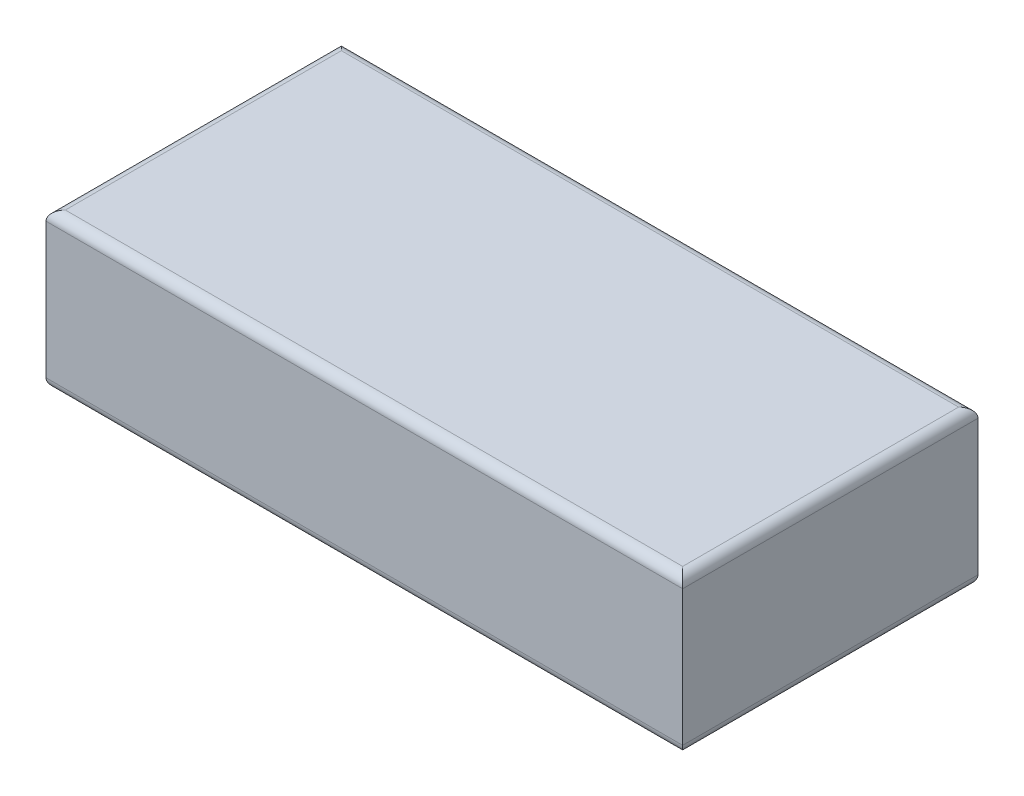
ISO-10303-21;
HEADER;
FILE_DESCRIPTION(('STEP AP214'),'2;1');
FILE_NAME('part.step','',(''),(''),'','','');
FILE_SCHEMA(('AUTOMOTIVE_DESIGN { 1 0 10303 214 1 1 1 1 }'));
ENDSEC;
DATA;
#1=APPLICATION_CONTEXT('core data for automotive mechanical design processes');
#2=APPLICATION_PROTOCOL_DEFINITION('international standard','automotive_design',2000,#1);
#3=PRODUCT_CONTEXT('',#1,'mechanical');
#4=PRODUCT('Part','Part','',(#3));
#5=PRODUCT_RELATED_PRODUCT_CATEGORY('part','',(#4));
#6=PRODUCT_DEFINITION_FORMATION('','',#4);
#7=PRODUCT_DEFINITION_CONTEXT('part definition',#1,'design');
#8=PRODUCT_DEFINITION('design','',#6,#7);
#9=PRODUCT_DEFINITION_SHAPE('','',#8);
#10=(LENGTH_UNIT() NAMED_UNIT(*) SI_UNIT(.MILLI.,.METRE.));
#11=(NAMED_UNIT(*) PLANE_ANGLE_UNIT() SI_UNIT($,.RADIAN.));
#12=(NAMED_UNIT(*) SI_UNIT($,.STERADIAN.) SOLID_ANGLE_UNIT());
#13=UNCERTAINTY_MEASURE_WITH_UNIT(LENGTH_MEASURE(1.E-05),#10,'distance_accuracy_value','');
#14=(GEOMETRIC_REPRESENTATION_CONTEXT(3) GLOBAL_UNCERTAINTY_ASSIGNED_CONTEXT((#13)) GLOBAL_UNIT_ASSIGNED_CONTEXT((#10,
#11,#12)) REPRESENTATION_CONTEXT('',''));
#15=CARTESIAN_POINT('',(0.,0.,0.));
#16=DIRECTION('',(0.,0.,1.));
#17=DIRECTION('',(1.,0.,0.));
#18=AXIS2_PLACEMENT_3D('',#15,#16,#17);
#19=CARTESIAN_POINT('',(0.,64.,0.));
#20=DIRECTION('',(1.,0.,0.));
#21=DIRECTION('',(0.,0.,-1.));
#22=AXIS2_PLACEMENT_3D('',#19,#20,#21);
#23=PLANE('',#22);
#24=DIRECTION('',(0.,-1.,0.));
#25=VECTOR('',#24,1.);
#26=CARTESIAN_POINT('',(0.,64.,-122.));
#27=LINE('',#26,#25);
#28=CARTESIAN_POINT('',(0.,60.,-122.));
#29=VERTEX_POINT('',#28);
#30=CARTESIAN_POINT('',(0.,4.,-122.));
#31=VERTEX_POINT('',#30);
#32=EDGE_CURVE('E113',#29,#31,#27,.T.);
#33=ORIENTED_EDGE('',*,*,#32,.T.);
#34=DIRECTION('',(0.,0.,1.));
#35=VECTOR('',#34,1.);
#36=CARTESIAN_POINT('',(0.,4.,0.));
#37=LINE('',#36,#35);
#38=CARTESIAN_POINT('',(0.,4.,0.));
#39=VERTEX_POINT('',#38);
#40=EDGE_CURVE('E186',#31,#39,#37,.T.);
#41=ORIENTED_EDGE('',*,*,#40,.T.);
#42=DIRECTION('',(0.,-1.,0.));
#43=VECTOR('',#42,1.);
#44=CARTESIAN_POINT('',(0.,64.,0.));
#45=LINE('',#44,#43);
#46=CARTESIAN_POINT('',(0.,60.,0.));
#47=VERTEX_POINT('',#46);
#48=EDGE_CURVE('E135',#47,#39,#45,.T.);
#49=ORIENTED_EDGE('',*,*,#48,.F.);
#50=DIRECTION('',(0.,0.,1.));
#51=VECTOR('',#50,1.);
#52=CARTESIAN_POINT('',(0.,60.,0.));
#53=LINE('',#52,#51);
#54=EDGE_CURVE('E184',#47,#29,#53,.F.);
#55=ORIENTED_EDGE('',*,*,#54,.T.);
#56=EDGE_LOOP('',(#33,#41,#49,#55));
#57=FACE_BOUND('',#56,.T.);
#58=ADVANCED_FACE('F40',(#57),#23,.F.);
#59=CARTESIAN_POINT('',(0.,64.,0.));
#60=DIRECTION('',(0.,0.,-1.));
#61=DIRECTION('',(-1.,0.,0.));
#62=AXIS2_PLACEMENT_3D('',#59,#60,#61);
#63=PLANE('',#62);
#64=ORIENTED_EDGE('',*,*,#48,.T.);
#65=DIRECTION('',(1.,0.,0.));
#66=VECTOR('',#65,1.);
#67=CARTESIAN_POINT('',(263.,4.,0.));
#68=LINE('',#67,#66);
#69=CARTESIAN_POINT('',(263.,4.,0.));
#70=VERTEX_POINT('',#69);
#71=EDGE_CURVE('E190',#39,#70,#68,.T.);
#72=ORIENTED_EDGE('',*,*,#71,.T.);
#73=DIRECTION('',(0.,-1.,0.));
#74=VECTOR('',#73,1.);
#75=CARTESIAN_POINT('',(263.,64.,0.));
#76=LINE('',#75,#74);
#77=CARTESIAN_POINT('',(263.,60.,0.));
#78=VERTEX_POINT('',#77);
#79=EDGE_CURVE('E129',#78,#70,#76,.T.);
#80=ORIENTED_EDGE('',*,*,#79,.F.);
#81=DIRECTION('',(1.,0.,0.));
#82=VECTOR('',#81,1.);
#83=CARTESIAN_POINT('',(0.,60.,0.));
#84=LINE('',#83,#82);
#85=EDGE_CURVE('E188',#78,#47,#84,.F.);
#86=ORIENTED_EDGE('',*,*,#85,.T.);
#87=EDGE_LOOP('',(#64,#72,#80,#86));
#88=FACE_BOUND('',#87,.T.);
#89=ADVANCED_FACE('F201',(#88),#63,.F.);
#90=CARTESIAN_POINT('',(263.,64.,0.));
#91=DIRECTION('',(-1.,0.,0.));
#92=DIRECTION('',(0.,0.,1.));
#93=AXIS2_PLACEMENT_3D('',#90,#91,#92);
#94=PLANE('',#93);
#95=ORIENTED_EDGE('',*,*,#79,.T.);
#96=DIRECTION('',(0.,0.,-1.));
#97=VECTOR('',#96,1.);
#98=CARTESIAN_POINT('',(263.,4.,-122.));
#99=LINE('',#98,#97);
#100=CARTESIAN_POINT('',(263.,4.,-122.));
#101=VERTEX_POINT('',#100);
#102=EDGE_CURVE('E128',#70,#101,#99,.T.);
#103=ORIENTED_EDGE('',*,*,#102,.T.);
#104=DIRECTION('',(0.,-1.,0.));
#105=VECTOR('',#104,1.);
#106=CARTESIAN_POINT('',(263.,64.,-122.));
#107=LINE('',#106,#105);
#108=CARTESIAN_POINT('',(263.,60.,-122.));
#109=VERTEX_POINT('',#108);
#110=EDGE_CURVE('E111',#109,#101,#107,.T.);
#111=ORIENTED_EDGE('',*,*,#110,.F.);
#112=DIRECTION('',(0.,0.,-1.));
#113=VECTOR('',#112,1.);
#114=CARTESIAN_POINT('',(263.,60.,0.));
#115=LINE('',#114,#113);
#116=EDGE_CURVE('E125',#109,#78,#115,.F.);
#117=ORIENTED_EDGE('',*,*,#116,.T.);
#118=EDGE_LOOP('',(#95,#103,#111,#117));
#119=FACE_BOUND('',#118,.T.);
#120=ADVANCED_FACE('F124',(#119),#94,.F.);
#121=CARTESIAN_POINT('',(0.,64.,-122.));
#122=DIRECTION('',(0.,0.,1.));
#123=DIRECTION('',(1.,0.,0.));
#124=AXIS2_PLACEMENT_3D('',#121,#122,#123);
#125=PLANE('',#124);
#126=ORIENTED_EDGE('',*,*,#110,.T.);
#127=DIRECTION('',(-1.,0.,0.));
#128=VECTOR('',#127,1.);
#129=CARTESIAN_POINT('',(0.,4.,-122.));
#130=LINE('',#129,#128);
#131=EDGE_CURVE('E117',#101,#31,#130,.T.);
#132=ORIENTED_EDGE('',*,*,#131,.T.);
#133=ORIENTED_EDGE('',*,*,#32,.F.);
#134=DIRECTION('',(-1.,0.,0.));
#135=VECTOR('',#134,1.);
#136=CARTESIAN_POINT('',(0.,60.,-122.));
#137=LINE('',#136,#135);
#138=EDGE_CURVE('E108',#29,#109,#137,.F.);
#139=ORIENTED_EDGE('',*,*,#138,.T.);
#140=EDGE_LOOP('',(#126,#132,#133,#139));
#141=FACE_BOUND('',#140,.T.);
#142=ADVANCED_FACE('F110',(#141),#125,.F.);
#143=CARTESIAN_POINT('',(0.,64.,0.));
#144=DIRECTION('',(0.,-1.,0.));
#145=DIRECTION('',(0.,0.,-1.));
#146=AXIS2_PLACEMENT_3D('',#143,#144,#145);
#147=PLANE('',#146);
#148=DIRECTION('',(1.,0.,0.));
#149=VECTOR('',#148,1.);
#150=CARTESIAN_POINT('',(0.,64.,-4.));
#151=LINE('',#150,#149);
#152=CARTESIAN_POINT('',(4.,64.,-4.));
#153=VERTEX_POINT('',#152);
#154=CARTESIAN_POINT('',(259.,64.,-4.));
#155=VERTEX_POINT('',#154);
#156=EDGE_CURVE('E192',#153,#155,#151,.T.);
#157=ORIENTED_EDGE('',*,*,#156,.T.);
#158=DIRECTION('',(0.,0.,-1.));
#159=VECTOR('',#158,1.);
#160=CARTESIAN_POINT('',(259.,64.,0.));
#161=LINE('',#160,#159);
#162=CARTESIAN_POINT('',(259.,64.,-118.));
#163=VERTEX_POINT('',#162);
#164=EDGE_CURVE('E11',#155,#163,#161,.T.);
#165=ORIENTED_EDGE('',*,*,#164,.T.);
#166=DIRECTION('',(-1.,0.,0.));
#167=VECTOR('',#166,1.);
#168=CARTESIAN_POINT('',(0.,64.,-118.));
#169=LINE('',#168,#167);
#170=CARTESIAN_POINT('',(4.,64.,-118.));
#171=VERTEX_POINT('',#170);
#172=EDGE_CURVE('E49',#163,#171,#169,.T.);
#173=ORIENTED_EDGE('',*,*,#172,.T.);
#174=DIRECTION('',(0.,0.,1.));
#175=VECTOR('',#174,1.);
#176=CARTESIAN_POINT('',(4.,64.,0.));
#177=LINE('',#176,#175);
#178=EDGE_CURVE('E194',#171,#153,#177,.T.);
#179=ORIENTED_EDGE('',*,*,#178,.T.);
#180=EDGE_LOOP('',(#157,#165,#173,#179));
#181=FACE_BOUND('',#180,.T.);
#182=ADVANCED_FACE('F195',(#181),#147,.F.);
#183=CARTESIAN_POINT('',(0.,0.,0.));
#184=DIRECTION('',(0.,-1.,0.));
#185=DIRECTION('',(0.,0.,-1.));
#186=AXIS2_PLACEMENT_3D('',#183,#184,#185);
#187=PLANE('',#186);
#188=DIRECTION('',(-1.,0.,0.));
#189=VECTOR('',#188,1.);
#190=CARTESIAN_POINT('',(263.,0.,-118.));
#191=LINE('',#190,#189);
#192=CARTESIAN_POINT('',(4.,0.,-118.));
#193=VERTEX_POINT('',#192);
#194=CARTESIAN_POINT('',(259.,0.,-118.));
#195=VERTEX_POINT('',#194);
#196=EDGE_CURVE('E179',#193,#195,#191,.F.);
#197=ORIENTED_EDGE('',*,*,#196,.T.);
#198=DIRECTION('',(0.,0.,-1.));
#199=VECTOR('',#198,1.);
#200=CARTESIAN_POINT('',(259.,0.,0.));
#201=LINE('',#200,#199);
#202=CARTESIAN_POINT('',(259.,0.,-4.));
#203=VERTEX_POINT('',#202);
#204=EDGE_CURVE('E118',#195,#203,#201,.F.);
#205=ORIENTED_EDGE('',*,*,#204,.T.);
#206=DIRECTION('',(1.,0.,0.));
#207=VECTOR('',#206,1.);
#208=CARTESIAN_POINT('',(0.,0.,-4.));
#209=LINE('',#208,#207);
#210=CARTESIAN_POINT('',(4.,0.,-4.));
#211=VERTEX_POINT('',#210);
#212=EDGE_CURVE('E175',#203,#211,#209,.F.);
#213=ORIENTED_EDGE('',*,*,#212,.T.);
#214=DIRECTION('',(0.,0.,1.));
#215=VECTOR('',#214,1.);
#216=CARTESIAN_POINT('',(4.,0.,-122.));
#217=LINE('',#216,#215);
#218=EDGE_CURVE('E177',#211,#193,#217,.F.);
#219=ORIENTED_EDGE('',*,*,#218,.T.);
#220=EDGE_LOOP('',(#197,#205,#213,#219));
#221=FACE_BOUND('',#220,.T.);
#222=ADVANCED_FACE('F227',(#221),#187,.T.);
#223=CARTESIAN_POINT('',(4.,4.,0.));
#224=DIRECTION('',(0.,0.,-1.));
#225=DIRECTION('',(-1.,0.,0.));
#226=AXIS2_PLACEMENT_3D('',#223,#224,#225);
#227=CYLINDRICAL_SURFACE('',#226,4.);
#228=CARTESIAN_POINT('',(4.,4.,-118.));
#229=DIRECTION('',(0.707106781186547,0.,-0.707106781186547));
#230=DIRECTION('',(-0.707106781186547,0.,-0.707106781186547));
#231=AXIS2_PLACEMENT_3D('',#228,#229,#230);
#232=ELLIPSE('',#231,5.65685424949238,4.);
#233=EDGE_CURVE('E155',#193,#31,#232,.T.);
#234=ORIENTED_EDGE('',*,*,#233,.F.);
#235=ORIENTED_EDGE('',*,*,#218,.F.);
#236=CARTESIAN_POINT('',(4.,4.,-4.));
#237=DIRECTION('',(-0.707106781186547,0.,-0.707106781186547));
#238=DIRECTION('',(-0.707106781186547,0.,0.707106781186547));
#239=AXIS2_PLACEMENT_3D('',#236,#237,#238);
#240=ELLIPSE('',#239,5.65685424949238,4.);
#241=EDGE_CURVE('E142',#39,#211,#240,.F.);
#242=ORIENTED_EDGE('',*,*,#241,.F.);
#243=ORIENTED_EDGE('',*,*,#40,.F.);
#244=EDGE_LOOP('',(#234,#235,#242,#243));
#245=FACE_BOUND('',#244,.T.);
#246=ADVANCED_FACE('F203',(#245),#227,.T.);
#247=CARTESIAN_POINT('',(0.,4.,-4.));
#248=DIRECTION('',(-1.,0.,0.));
#249=DIRECTION('',(0.,0.,1.));
#250=AXIS2_PLACEMENT_3D('',#247,#248,#249);
#251=CYLINDRICAL_SURFACE('',#250,4.);
#252=ORIENTED_EDGE('',*,*,#241,.T.);
#253=ORIENTED_EDGE('',*,*,#212,.F.);
#254=CARTESIAN_POINT('',(259.,4.,-4.));
#255=DIRECTION('',(-0.707106781186547,0.,0.707106781186547));
#256=DIRECTION('',(-0.707106781186547,0.,-0.707106781186547));
#257=AXIS2_PLACEMENT_3D('',#254,#255,#256);
#258=ELLIPSE('',#257,5.65685424949238,4.);
#259=EDGE_CURVE('E149',#70,#203,#258,.F.);
#260=ORIENTED_EDGE('',*,*,#259,.F.);
#261=ORIENTED_EDGE('',*,*,#71,.F.);
#262=EDGE_LOOP('',(#252,#253,#260,#261));
#263=FACE_BOUND('',#262,.T.);
#264=ADVANCED_FACE('F206',(#263),#251,.T.);
#265=CARTESIAN_POINT('',(0.,4.,-118.));
#266=DIRECTION('',(1.,0.,0.));
#267=DIRECTION('',(0.,0.,-1.));
#268=AXIS2_PLACEMENT_3D('',#265,#266,#267);
#269=CYLINDRICAL_SURFACE('',#268,4.);
#270=ORIENTED_EDGE('',*,*,#233,.T.);
#271=ORIENTED_EDGE('',*,*,#131,.F.);
#272=CARTESIAN_POINT('',(259.,4.,-118.));
#273=DIRECTION('',(0.707106781186547,0.,0.707106781186547));
#274=DIRECTION('',(0.707106781186547,0.,-0.707106781186547));
#275=AXIS2_PLACEMENT_3D('',#272,#273,#274);
#276=ELLIPSE('',#275,5.65685424949238,4.);
#277=EDGE_CURVE('E145',#195,#101,#276,.T.);
#278=ORIENTED_EDGE('',*,*,#277,.F.);
#279=ORIENTED_EDGE('',*,*,#196,.F.);
#280=EDGE_LOOP('',(#270,#271,#278,#279));
#281=FACE_BOUND('',#280,.T.);
#282=ADVANCED_FACE('F209',(#281),#269,.T.);
#283=CARTESIAN_POINT('',(259.,4.,0.));
#284=DIRECTION('',(0.,0.,1.));
#285=DIRECTION('',(1.,0.,0.));
#286=AXIS2_PLACEMENT_3D('',#283,#284,#285);
#287=CYLINDRICAL_SURFACE('',#286,4.);
#288=ORIENTED_EDGE('',*,*,#259,.T.);
#289=ORIENTED_EDGE('',*,*,#204,.F.);
#290=ORIENTED_EDGE('',*,*,#277,.T.);
#291=ORIENTED_EDGE('',*,*,#102,.F.);
#292=EDGE_LOOP('',(#288,#289,#290,#291));
#293=FACE_BOUND('',#292,.T.);
#294=ADVANCED_FACE('F207',(#293),#287,.T.);
#295=CARTESIAN_POINT('',(4.,60.,0.));
#296=DIRECTION('',(0.,0.,1.));
#297=DIRECTION('',(1.,0.,0.));
#298=AXIS2_PLACEMENT_3D('',#295,#296,#297);
#299=CYLINDRICAL_SURFACE('',#298,4.);
#300=CARTESIAN_POINT('',(4.,60.,-118.));
#301=DIRECTION('',(-0.707106781186547,0.,0.707106781186547));
#302=DIRECTION('',(0.707106781186547,0.,0.707106781186547));
#303=AXIS2_PLACEMENT_3D('',#300,#301,#302);
#304=ELLIPSE('',#303,5.65685424949238,4.);
#305=EDGE_CURVE('E139',#29,#171,#304,.F.);
#306=ORIENTED_EDGE('',*,*,#305,.F.);
#307=ORIENTED_EDGE('',*,*,#54,.F.);
#308=CARTESIAN_POINT('',(4.,60.,-4.));
#309=DIRECTION('',(0.707106781186547,0.,0.707106781186547));
#310=DIRECTION('',(0.707106781186547,0.,-0.707106781186547));
#311=AXIS2_PLACEMENT_3D('',#308,#309,#310);
#312=ELLIPSE('',#311,5.65685424949238,4.);
#313=EDGE_CURVE('E44',#153,#47,#312,.T.);
#314=ORIENTED_EDGE('',*,*,#313,.F.);
#315=ORIENTED_EDGE('',*,*,#178,.F.);
#316=EDGE_LOOP('',(#306,#307,#314,#315));
#317=FACE_BOUND('',#316,.T.);
#318=ADVANCED_FACE('F42',(#317),#299,.T.);
#319=CARTESIAN_POINT('',(0.,60.,-4.));
#320=DIRECTION('',(1.,0.,0.));
#321=DIRECTION('',(0.,0.,-1.));
#322=AXIS2_PLACEMENT_3D('',#319,#320,#321);
#323=CYLINDRICAL_SURFACE('',#322,4.);
#324=ORIENTED_EDGE('',*,*,#313,.T.);
#325=ORIENTED_EDGE('',*,*,#85,.F.);
#326=CARTESIAN_POINT('',(259.,60.,-4.));
#327=DIRECTION('',(0.707106781186547,0.,-0.707106781186547));
#328=DIRECTION('',(0.707106781186547,0.,0.707106781186547));
#329=AXIS2_PLACEMENT_3D('',#326,#327,#328);
#330=ELLIPSE('',#329,5.65685424949238,4.);
#331=EDGE_CURVE('E133',#155,#78,#330,.T.);
#332=ORIENTED_EDGE('',*,*,#331,.F.);
#333=ORIENTED_EDGE('',*,*,#156,.F.);
#334=EDGE_LOOP('',(#324,#325,#332,#333));
#335=FACE_BOUND('',#334,.T.);
#336=ADVANCED_FACE('F198',(#335),#323,.T.);
#337=CARTESIAN_POINT('',(0.,60.,-118.));
#338=DIRECTION('',(-1.,0.,0.));
#339=DIRECTION('',(0.,0.,1.));
#340=AXIS2_PLACEMENT_3D('',#337,#338,#339);
#341=CYLINDRICAL_SURFACE('',#340,4.);
#342=ORIENTED_EDGE('',*,*,#305,.T.);
#343=ORIENTED_EDGE('',*,*,#172,.F.);
#344=CARTESIAN_POINT('',(259.,60.,-118.));
#345=DIRECTION('',(-0.707106781186547,0.,-0.707106781186547));
#346=DIRECTION('',(-0.707106781186547,0.,0.707106781186547));
#347=AXIS2_PLACEMENT_3D('',#344,#345,#346);
#348=ELLIPSE('',#347,5.65685424949238,4.);
#349=EDGE_CURVE('E57',#109,#163,#348,.F.);
#350=ORIENTED_EDGE('',*,*,#349,.F.);
#351=ORIENTED_EDGE('',*,*,#138,.F.);
#352=EDGE_LOOP('',(#342,#343,#350,#351));
#353=FACE_BOUND('',#352,.T.);
#354=ADVANCED_FACE('F137',(#353),#341,.T.);
#355=CARTESIAN_POINT('',(259.,60.,0.));
#356=DIRECTION('',(0.,0.,-1.));
#357=DIRECTION('',(-1.,0.,0.));
#358=AXIS2_PLACEMENT_3D('',#355,#356,#357);
#359=CYLINDRICAL_SURFACE('',#358,4.);
#360=ORIENTED_EDGE('',*,*,#331,.T.);
#361=ORIENTED_EDGE('',*,*,#116,.F.);
#362=ORIENTED_EDGE('',*,*,#349,.T.);
#363=ORIENTED_EDGE('',*,*,#164,.F.);
#364=EDGE_LOOP('',(#360,#361,#362,#363));
#365=FACE_BOUND('',#364,.T.);
#366=ADVANCED_FACE('F131',(#365),#359,.T.);
#367=CLOSED_SHELL('',(#58,#89,#120,#142,#182,#222,#246,#264,#282,#294,#318,#336,#354,#366));
#368=MANIFOLD_SOLID_BREP('B2',#367);
#369=ADVANCED_BREP_SHAPE_REPRESENTATION('',(#18,#368),#14);
#370=SHAPE_DEFINITION_REPRESENTATION(#9,#369);
ENDSEC;
END-ISO-10303-21;
